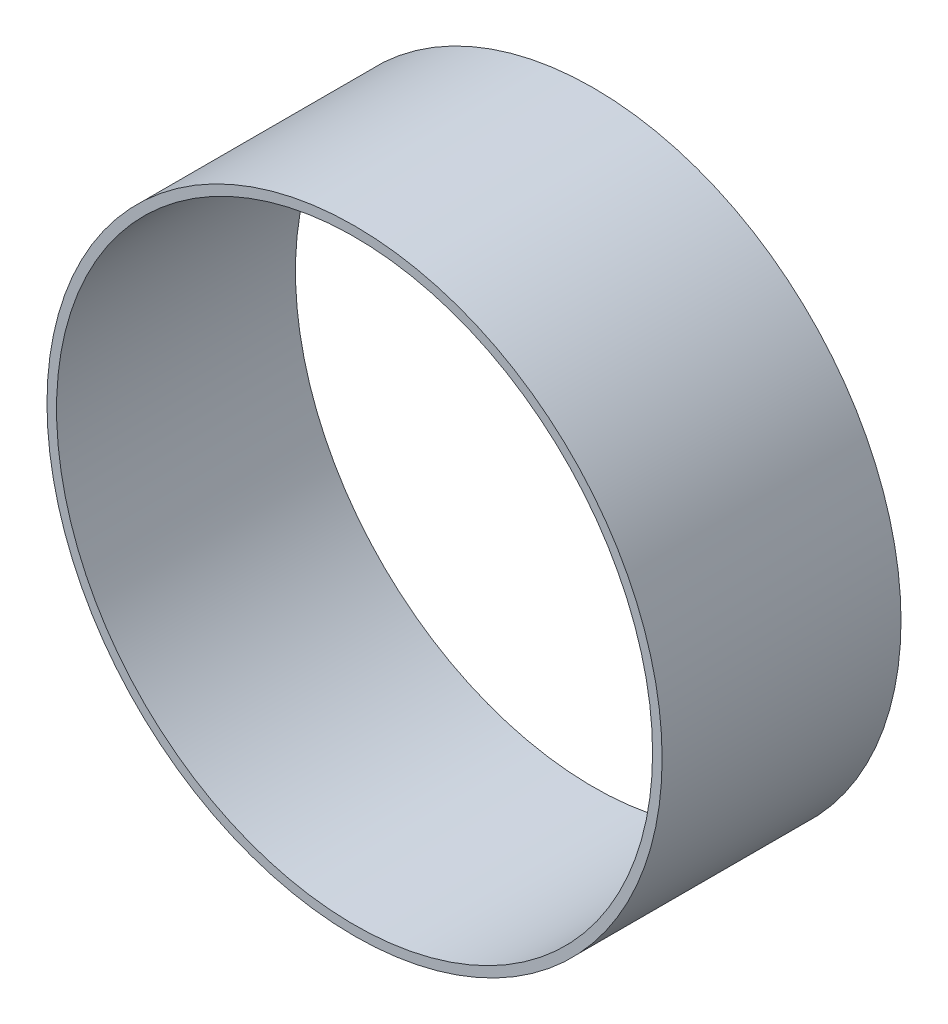
ISO-10303-21;
HEADER;
FILE_DESCRIPTION(('STEP AP214'),'2;1');
FILE_NAME('part.step','',(''),(''),'','','');
FILE_SCHEMA(('AUTOMOTIVE_DESIGN { 1 0 10303 214 1 1 1 1 }'));
ENDSEC;
DATA;
#1=APPLICATION_CONTEXT('core data for automotive mechanical design processes');
#2=APPLICATION_PROTOCOL_DEFINITION('international standard','automotive_design',2000,#1);
#3=PRODUCT_CONTEXT('',#1,'mechanical');
#4=PRODUCT('Part','Part','',(#3));
#5=PRODUCT_RELATED_PRODUCT_CATEGORY('part','',(#4));
#6=PRODUCT_DEFINITION_FORMATION('','',#4);
#7=PRODUCT_DEFINITION_CONTEXT('part definition',#1,'design');
#8=PRODUCT_DEFINITION('design','',#6,#7);
#9=PRODUCT_DEFINITION_SHAPE('','',#8);
#10=(LENGTH_UNIT() NAMED_UNIT(*) SI_UNIT(.MILLI.,.METRE.));
#11=(NAMED_UNIT(*) PLANE_ANGLE_UNIT() SI_UNIT($,.RADIAN.));
#12=(NAMED_UNIT(*) SI_UNIT($,.STERADIAN.) SOLID_ANGLE_UNIT());
#13=UNCERTAINTY_MEASURE_WITH_UNIT(LENGTH_MEASURE(1.E-05),#10,'distance_accuracy_value','');
#14=(GEOMETRIC_REPRESENTATION_CONTEXT(3) GLOBAL_UNCERTAINTY_ASSIGNED_CONTEXT((#13)) GLOBAL_UNIT_ASSIGNED_CONTEXT((#10,
#11,#12)) REPRESENTATION_CONTEXT('',''));
#15=CARTESIAN_POINT('',(0.,0.,0.));
#16=DIRECTION('',(0.,0.,1.));
#17=DIRECTION('',(1.,0.,0.));
#18=AXIS2_PLACEMENT_3D('',#15,#16,#17);
#19=CARTESIAN_POINT('',(0.,0.,25.4));
#20=DIRECTION('',(0.,0.,1.));
#21=DIRECTION('',(1.,0.,0.));
#22=AXIS2_PLACEMENT_3D('',#19,#20,#21);
#23=PLANE('',#22);
#24=CARTESIAN_POINT('',(0.,0.,25.4));
#25=DIRECTION('',(0.,0.,1.));
#26=DIRECTION('',(1.,0.,0.));
#27=AXIS2_PLACEMENT_3D('',#24,#25,#26);
#28=CIRCLE('',#27,65.405);
#29=CARTESIAN_POINT('',(65.405,0.,25.4));
#30=VERTEX_POINT('',#29);
#31=EDGE_CURVE('E10',#30,#30,#28,.T.);
#32=ORIENTED_EDGE('',*,*,#31,.T.);
#33=EDGE_LOOP('',(#32));
#34=FACE_BOUND('',#33,.T.);
#35=CARTESIAN_POINT('',(0.,0.,25.4));
#36=DIRECTION('',(0.,0.,1.));
#37=DIRECTION('',(1.,0.,0.));
#38=AXIS2_PLACEMENT_3D('',#35,#36,#37);
#39=CIRCLE('',#38,63.373);
#40=CARTESIAN_POINT('',(63.373,0.,25.4));
#41=VERTEX_POINT('',#40);
#42=EDGE_CURVE('E54',#41,#41,#39,.T.);
#43=ORIENTED_EDGE('',*,*,#42,.F.);
#44=EDGE_LOOP('',(#43));
#45=FACE_BOUND('',#44,.T.);
#46=ADVANCED_FACE('F43',(#34,#45),#23,.T.);
#47=CARTESIAN_POINT('',(0.,0.,-25.4));
#48=DIRECTION('',(0.,0.,1.));
#49=DIRECTION('',(1.,0.,0.));
#50=AXIS2_PLACEMENT_3D('',#47,#48,#49);
#51=PLANE('',#50);
#52=CARTESIAN_POINT('',(0.,0.,-25.4));
#53=DIRECTION('',(0.,0.,1.));
#54=DIRECTION('',(1.,0.,0.));
#55=AXIS2_PLACEMENT_3D('',#52,#53,#54);
#56=CIRCLE('',#55,65.405);
#57=CARTESIAN_POINT('',(65.405,0.,-25.4));
#58=VERTEX_POINT('',#57);
#59=EDGE_CURVE('E47',#58,#58,#56,.T.);
#60=ORIENTED_EDGE('',*,*,#59,.F.);
#61=EDGE_LOOP('',(#60));
#62=FACE_BOUND('',#61,.T.);
#63=CARTESIAN_POINT('',(0.,0.,-25.4));
#64=DIRECTION('',(0.,0.,1.));
#65=DIRECTION('',(1.,0.,0.));
#66=AXIS2_PLACEMENT_3D('',#63,#64,#65);
#67=CIRCLE('',#66,63.373);
#68=CARTESIAN_POINT('',(63.373,0.,-25.4));
#69=VERTEX_POINT('',#68);
#70=EDGE_CURVE('E56',#69,#69,#67,.T.);
#71=ORIENTED_EDGE('',*,*,#70,.T.);
#72=EDGE_LOOP('',(#71));
#73=FACE_BOUND('',#72,.T.);
#74=ADVANCED_FACE('F66',(#62,#73),#51,.F.);
#75=CARTESIAN_POINT('',(0.,0.,25.4));
#76=DIRECTION('',(0.,0.,-1.));
#77=DIRECTION('',(-1.,0.,0.));
#78=AXIS2_PLACEMENT_3D('',#75,#76,#77);
#79=CYLINDRICAL_SURFACE('',#78,65.405);
#80=ORIENTED_EDGE('',*,*,#31,.F.);
#81=EDGE_LOOP('',(#80));
#82=FACE_BOUND('',#81,.T.);
#83=ORIENTED_EDGE('',*,*,#59,.T.);
#84=EDGE_LOOP('',(#83));
#85=FACE_BOUND('',#84,.T.);
#86=ADVANCED_FACE('F45',(#82,#85),#79,.T.);
#87=CARTESIAN_POINT('',(0.,0.,25.4));
#88=DIRECTION('',(0.,0.,-1.));
#89=DIRECTION('',(-1.,0.,0.));
#90=AXIS2_PLACEMENT_3D('',#87,#88,#89);
#91=CYLINDRICAL_SURFACE('',#90,63.373);
#92=ORIENTED_EDGE('',*,*,#42,.T.);
#93=EDGE_LOOP('',(#92));
#94=FACE_BOUND('',#93,.T.);
#95=ORIENTED_EDGE('',*,*,#70,.F.);
#96=EDGE_LOOP('',(#95));
#97=FACE_BOUND('',#96,.T.);
#98=ADVANCED_FACE('F62',(#94,#97),#91,.F.);
#99=CLOSED_SHELL('',(#46,#74,#86,#98));
#100=MANIFOLD_SOLID_BREP('B2',#99);
#101=ADVANCED_BREP_SHAPE_REPRESENTATION('',(#18,#100),#14);
#102=SHAPE_DEFINITION_REPRESENTATION(#9,#101);
ENDSEC;
END-ISO-10303-21;
